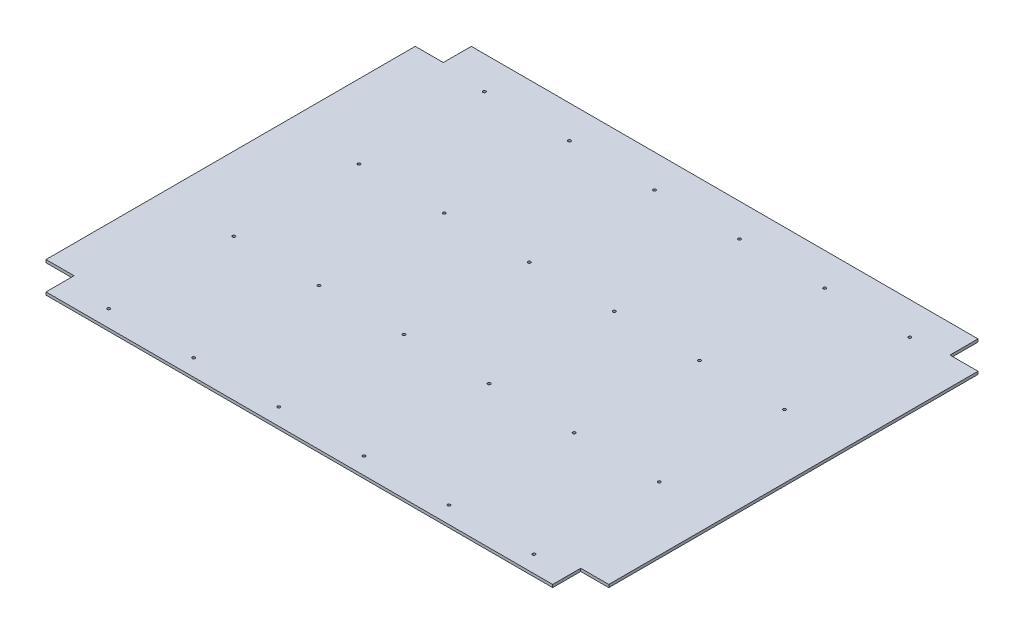
ISO-10303-21;
HEADER;
FILE_DESCRIPTION(('STEP AP214'),'2;1');
FILE_NAME('part.step','',(''),(''),'','','');
FILE_SCHEMA(('AUTOMOTIVE_DESIGN { 1 0 10303 214 1 1 1 1 }'));
ENDSEC;
DATA;
#1=APPLICATION_CONTEXT('core data for automotive mechanical design processes');
#2=APPLICATION_PROTOCOL_DEFINITION('international standard','automotive_design',2000,#1);
#3=PRODUCT_CONTEXT('',#1,'mechanical');
#4=PRODUCT('Part','Part','',(#3));
#5=PRODUCT_RELATED_PRODUCT_CATEGORY('part','',(#4));
#6=PRODUCT_DEFINITION_FORMATION('','',#4);
#7=PRODUCT_DEFINITION_CONTEXT('part definition',#1,'design');
#8=PRODUCT_DEFINITION('design','',#6,#7);
#9=PRODUCT_DEFINITION_SHAPE('','',#8);
#10=(LENGTH_UNIT() NAMED_UNIT(*) SI_UNIT(.MILLI.,.METRE.));
#11=(NAMED_UNIT(*) PLANE_ANGLE_UNIT() SI_UNIT($,.RADIAN.));
#12=(NAMED_UNIT(*) SI_UNIT($,.STERADIAN.) SOLID_ANGLE_UNIT());
#13=UNCERTAINTY_MEASURE_WITH_UNIT(LENGTH_MEASURE(1.E-05),#10,'distance_accuracy_value','');
#14=(GEOMETRIC_REPRESENTATION_CONTEXT(3) GLOBAL_UNCERTAINTY_ASSIGNED_CONTEXT((#13)) GLOBAL_UNIT_ASSIGNED_CONTEXT((#10,
#11,#12)) REPRESENTATION_CONTEXT('',''));
#15=CARTESIAN_POINT('',(0.,0.,0.));
#16=DIRECTION('',(0.,0.,1.));
#17=DIRECTION('',(1.,0.,0.));
#18=AXIS2_PLACEMENT_3D('',#15,#16,#17);
#19=CARTESIAN_POINT('',(542.,3.,0.));
#20=DIRECTION('',(-1.,0.,0.));
#21=DIRECTION('',(0.,0.,1.));
#22=AXIS2_PLACEMENT_3D('',#19,#20,#21);
#23=PLANE('',#22);
#24=DIRECTION('',(0.,-1.,0.));
#25=VECTOR('',#24,1.);
#26=CARTESIAN_POINT('',(542.,3.,-30.));
#27=LINE('',#26,#25);
#28=CARTESIAN_POINT('',(542.,3.,-30.));
#29=VERTEX_POINT('',#28);
#30=CARTESIAN_POINT('',(542.,0.,-30.));
#31=VERTEX_POINT('',#30);
#32=EDGE_CURVE('E136',#29,#31,#27,.T.);
#33=ORIENTED_EDGE('',*,*,#32,.F.);
#34=DIRECTION('',(0.,0.,-1.));
#35=VECTOR('',#34,1.);
#36=CARTESIAN_POINT('',(542.,3.,0.));
#37=LINE('',#36,#35);
#38=CARTESIAN_POINT('',(542.,3.,0.));
#39=VERTEX_POINT('',#38);
#40=EDGE_CURVE('E149',#39,#29,#37,.T.);
#41=ORIENTED_EDGE('',*,*,#40,.F.);
#42=DIRECTION('',(0.,-1.,0.));
#43=VECTOR('',#42,1.);
#44=CARTESIAN_POINT('',(542.,3.,0.));
#45=LINE('',#44,#43);
#46=CARTESIAN_POINT('',(542.,0.,0.));
#47=VERTEX_POINT('',#46);
#48=EDGE_CURVE('E48',#39,#47,#45,.T.);
#49=ORIENTED_EDGE('',*,*,#48,.T.);
#50=DIRECTION('',(0.,0.,-1.));
#51=VECTOR('',#50,1.);
#52=CARTESIAN_POINT('',(542.,0.,0.));
#53=LINE('',#52,#51);
#54=EDGE_CURVE('E151',#47,#31,#53,.T.);
#55=ORIENTED_EDGE('',*,*,#54,.T.);
#56=EDGE_LOOP('',(#33,#41,#49,#55));
#57=FACE_BOUND('',#56,.T.);
#58=ADVANCED_FACE('F39',(#57),#23,.F.);
#59=CARTESIAN_POINT('',(0.,3.,0.));
#60=DIRECTION('',(1.,0.,0.));
#61=DIRECTION('',(0.,0.,-1.));
#62=AXIS2_PLACEMENT_3D('',#59,#60,#61);
#63=PLANE('',#62);
#64=DIRECTION('',(0.,-1.,0.));
#65=VECTOR('',#64,1.);
#66=CARTESIAN_POINT('',(0.,3.,-425.));
#67=LINE('',#66,#65);
#68=CARTESIAN_POINT('',(0.,3.,-425.));
#69=VERTEX_POINT('',#68);
#70=CARTESIAN_POINT('',(0.,0.,-425.));
#71=VERTEX_POINT('',#70);
#72=EDGE_CURVE('E248',#69,#71,#67,.T.);
#73=ORIENTED_EDGE('',*,*,#72,.F.);
#74=DIRECTION('',(0.,0.,1.));
#75=VECTOR('',#74,1.);
#76=CARTESIAN_POINT('',(0.,3.,0.));
#77=LINE('',#76,#75);
#78=CARTESIAN_POINT('',(0.,3.,-455.));
#79=VERTEX_POINT('',#78);
#80=EDGE_CURVE('E443',#79,#69,#77,.T.);
#81=ORIENTED_EDGE('',*,*,#80,.F.);
#82=DIRECTION('',(0.,-1.,0.));
#83=VECTOR('',#82,1.);
#84=CARTESIAN_POINT('',(0.,3.,-455.));
#85=LINE('',#84,#83);
#86=CARTESIAN_POINT('',(0.,0.,-455.));
#87=VERTEX_POINT('',#86);
#88=EDGE_CURVE('E167',#79,#87,#85,.T.);
#89=ORIENTED_EDGE('',*,*,#88,.T.);
#90=DIRECTION('',(0.,0.,1.));
#91=VECTOR('',#90,1.);
#92=CARTESIAN_POINT('',(0.,0.,0.));
#93=LINE('',#92,#91);
#94=EDGE_CURVE('E172',#87,#71,#93,.T.);
#95=ORIENTED_EDGE('',*,*,#94,.T.);
#96=EDGE_LOOP('',(#73,#81,#89,#95));
#97=FACE_BOUND('',#96,.T.);
#98=ADVANCED_FACE('F473',(#97),#63,.F.);
#99=CARTESIAN_POINT('',(0.,3.,0.));
#100=DIRECTION('',(0.,-1.,0.));
#101=DIRECTION('',(0.,0.,-1.));
#102=AXIS2_PLACEMENT_3D('',#99,#100,#101);
#103=PLANE('',#102);
#104=ORIENTED_EDGE('',*,*,#80,.T.);
#105=DIRECTION('',(-1.,0.,0.));
#106=VECTOR('',#105,1.);
#107=CARTESIAN_POINT('',(0.,3.,-425.));
#108=LINE('',#107,#106);
#109=CARTESIAN_POINT('',(-30.,3.,-425.));
#110=VERTEX_POINT('',#109);
#111=EDGE_CURVE('E222',#69,#110,#108,.T.);
#112=ORIENTED_EDGE('',*,*,#111,.T.);
#113=DIRECTION('',(0.,0.,1.));
#114=VECTOR('',#113,1.);
#115=CARTESIAN_POINT('',(-30.,3.,-30.));
#116=LINE('',#115,#114);
#117=CARTESIAN_POINT('',(-30.,3.,-30.));
#118=VERTEX_POINT('',#117);
#119=EDGE_CURVE('E225',#110,#118,#116,.T.);
#120=ORIENTED_EDGE('',*,*,#119,.T.);
#121=DIRECTION('',(1.,0.,0.));
#122=VECTOR('',#121,1.);
#123=CARTESIAN_POINT('',(0.,3.,-30.));
#124=LINE('',#123,#122);
#125=CARTESIAN_POINT('',(0.,3.,-30.));
#126=VERTEX_POINT('',#125);
#127=EDGE_CURVE('E228',#118,#126,#124,.T.);
#128=ORIENTED_EDGE('',*,*,#127,.T.);
#129=CARTESIAN_POINT('',(0.,3.,0.));
#130=VERTEX_POINT('',#129);
#131=EDGE_CURVE('E186',#126,#130,#77,.T.);
#132=ORIENTED_EDGE('',*,*,#131,.T.);
#133=DIRECTION('',(1.,0.,0.));
#134=VECTOR('',#133,1.);
#135=CARTESIAN_POINT('',(0.,3.,0.));
#136=LINE('',#135,#134);
#137=EDGE_CURVE('E159',#130,#39,#136,.T.);
#138=ORIENTED_EDGE('',*,*,#137,.T.);
#139=ORIENTED_EDGE('',*,*,#40,.T.);
#140=DIRECTION('',(1.,0.,0.));
#141=VECTOR('',#140,1.);
#142=CARTESIAN_POINT('',(542.,3.,-30.));
#143=LINE('',#142,#141);
#144=CARTESIAN_POINT('',(572.,3.,-30.));
#145=VERTEX_POINT('',#144);
#146=EDGE_CURVE('E133',#29,#145,#143,.T.);
#147=ORIENTED_EDGE('',*,*,#146,.T.);
#148=DIRECTION('',(0.,0.,-1.));
#149=VECTOR('',#148,1.);
#150=CARTESIAN_POINT('',(572.,3.,-30.));
#151=LINE('',#150,#149);
#152=CARTESIAN_POINT('',(572.,3.,-425.));
#153=VERTEX_POINT('',#152);
#154=EDGE_CURVE('E144',#145,#153,#151,.T.);
#155=ORIENTED_EDGE('',*,*,#154,.T.);
#156=DIRECTION('',(-1.,0.,0.));
#157=VECTOR('',#156,1.);
#158=CARTESIAN_POINT('',(542.,3.,-425.));
#159=LINE('',#158,#157);
#160=CARTESIAN_POINT('',(542.,3.,-425.));
#161=VERTEX_POINT('',#160);
#162=EDGE_CURVE('E209',#153,#161,#159,.T.);
#163=ORIENTED_EDGE('',*,*,#162,.T.);
#164=CARTESIAN_POINT('',(542.,3.,-455.));
#165=VERTEX_POINT('',#164);
#166=EDGE_CURVE('E163',#161,#165,#37,.T.);
#167=ORIENTED_EDGE('',*,*,#166,.T.);
#168=DIRECTION('',(-1.,0.,0.));
#169=VECTOR('',#168,1.);
#170=CARTESIAN_POINT('',(0.,3.,-455.));
#171=LINE('',#170,#169);
#172=EDGE_CURVE('E162',#165,#79,#171,.T.);
#173=ORIENTED_EDGE('',*,*,#172,.T.);
#174=EDGE_LOOP('',(#104,#112,#120,#128,#132,#138,#139,#147,#155,#163,#167,#173));
#175=FACE_BOUND('',#174,.T.);
#176=CARTESIAN_POINT('',(140.,3.,-18.));
#177=DIRECTION('',(0.,1.,0.));
#178=DIRECTION('',(0.,0.,1.));
#179=AXIS2_PLACEMENT_3D('',#176,#177,#178);
#180=CIRCLE('',#179,1.5);
#181=CARTESIAN_POINT('',(140.,3.,-16.5));
#182=VERTEX_POINT('',#181);
#183=EDGE_CURVE('E437',#182,#182,#180,.T.);
#184=ORIENTED_EDGE('',*,*,#183,.F.);
#185=EDGE_LOOP('',(#184));
#186=FACE_BOUND('',#185,.T.);
#187=CARTESIAN_POINT('',(49.,3.,-18.));
#188=DIRECTION('',(0.,1.,0.));
#189=DIRECTION('',(0.,0.,1.));
#190=AXIS2_PLACEMENT_3D('',#187,#188,#189);
#191=CIRCLE('',#190,1.5);
#192=CARTESIAN_POINT('',(49.,3.,-16.5));
#193=VERTEX_POINT('',#192);
#194=EDGE_CURVE('E429',#193,#193,#191,.T.);
#195=ORIENTED_EDGE('',*,*,#194,.F.);
#196=EDGE_LOOP('',(#195));
#197=FACE_BOUND('',#196,.T.);
#198=CARTESIAN_POINT('',(231.,3.,-18.));
#199=DIRECTION('',(0.,1.,0.));
#200=DIRECTION('',(0.,0.,1.));
#201=AXIS2_PLACEMENT_3D('',#198,#199,#200);
#202=CIRCLE('',#201,1.5);
#203=CARTESIAN_POINT('',(231.,3.,-16.5));
#204=VERTEX_POINT('',#203);
#205=EDGE_CURVE('E421',#204,#204,#202,.T.);
#206=ORIENTED_EDGE('',*,*,#205,.F.);
#207=EDGE_LOOP('',(#206));
#208=FACE_BOUND('',#207,.T.);
#209=CARTESIAN_POINT('',(413.,3.,-18.));
#210=DIRECTION('',(0.,1.,0.));
#211=DIRECTION('',(0.,0.,1.));
#212=AXIS2_PLACEMENT_3D('',#209,#210,#211);
#213=CIRCLE('',#212,1.50000000000002);
#214=CARTESIAN_POINT('',(413.,3.,-16.5));
#215=VERTEX_POINT('',#214);
#216=EDGE_CURVE('E413',#215,#215,#213,.T.);
#217=ORIENTED_EDGE('',*,*,#216,.F.);
#218=EDGE_LOOP('',(#217));
#219=FACE_BOUND('',#218,.T.);
#220=CARTESIAN_POINT('',(504.,3.,-18.));
#221=DIRECTION('',(0.,1.,0.));
#222=DIRECTION('',(0.,0.,1.));
#223=AXIS2_PLACEMENT_3D('',#220,#221,#222);
#224=CIRCLE('',#223,1.49999999999997);
#225=CARTESIAN_POINT('',(504.,3.,-16.5));
#226=VERTEX_POINT('',#225);
#227=EDGE_CURVE('E405',#226,#226,#224,.T.);
#228=ORIENTED_EDGE('',*,*,#227,.F.);
#229=EDGE_LOOP('',(#228));
#230=FACE_BOUND('',#229,.T.);
#231=CARTESIAN_POINT('',(322.,3.,-18.));
#232=DIRECTION('',(0.,1.,0.));
#233=DIRECTION('',(0.,0.,1.));
#234=AXIS2_PLACEMENT_3D('',#231,#232,#233);
#235=CIRCLE('',#234,1.50000000000002);
#236=CARTESIAN_POINT('',(322.,3.,-16.5));
#237=VERTEX_POINT('',#236);
#238=EDGE_CURVE('E397',#237,#237,#235,.T.);
#239=ORIENTED_EDGE('',*,*,#238,.F.);
#240=EDGE_LOOP('',(#239));
#241=FACE_BOUND('',#240,.T.);
#242=CARTESIAN_POINT('',(140.,3.,-152.));
#243=DIRECTION('',(0.,1.,0.));
#244=DIRECTION('',(0.,0.,1.));
#245=AXIS2_PLACEMENT_3D('',#242,#243,#244);
#246=CIRCLE('',#245,1.5);
#247=CARTESIAN_POINT('',(140.,3.,-150.5));
#248=VERTEX_POINT('',#247);
#249=EDGE_CURVE('E389',#248,#248,#246,.T.);
#250=ORIENTED_EDGE('',*,*,#249,.F.);
#251=EDGE_LOOP('',(#250));
#252=FACE_BOUND('',#251,.T.);
#253=CARTESIAN_POINT('',(231.,3.,-152.));
#254=DIRECTION('',(0.,1.,0.));
#255=DIRECTION('',(0.,0.,1.));
#256=AXIS2_PLACEMENT_3D('',#253,#254,#255);
#257=CIRCLE('',#256,1.5);
#258=CARTESIAN_POINT('',(231.,3.,-150.5));
#259=VERTEX_POINT('',#258);
#260=EDGE_CURVE('E381',#259,#259,#257,.T.);
#261=ORIENTED_EDGE('',*,*,#260,.F.);
#262=EDGE_LOOP('',(#261));
#263=FACE_BOUND('',#262,.T.);
#264=CARTESIAN_POINT('',(322.,3.,-152.));
#265=DIRECTION('',(0.,1.,0.));
#266=DIRECTION('',(0.,0.,1.));
#267=AXIS2_PLACEMENT_3D('',#264,#265,#266);
#268=CIRCLE('',#267,1.50000000000002);
#269=CARTESIAN_POINT('',(322.,3.,-150.5));
#270=VERTEX_POINT('',#269);
#271=EDGE_CURVE('E373',#270,#270,#268,.T.);
#272=ORIENTED_EDGE('',*,*,#271,.F.);
#273=EDGE_LOOP('',(#272));
#274=FACE_BOUND('',#273,.T.);
#275=CARTESIAN_POINT('',(413.,3.,-152.));
#276=DIRECTION('',(0.,1.,0.));
#277=DIRECTION('',(0.,0.,1.));
#278=AXIS2_PLACEMENT_3D('',#275,#276,#277);
#279=CIRCLE('',#278,1.50000000000002);
#280=CARTESIAN_POINT('',(413.,3.,-150.5));
#281=VERTEX_POINT('',#280);
#282=EDGE_CURVE('E365',#281,#281,#279,.T.);
#283=ORIENTED_EDGE('',*,*,#282,.F.);
#284=EDGE_LOOP('',(#283));
#285=FACE_BOUND('',#284,.T.);
#286=CARTESIAN_POINT('',(504.,3.,-152.));
#287=DIRECTION('',(0.,1.,0.));
#288=DIRECTION('',(0.,0.,1.));
#289=AXIS2_PLACEMENT_3D('',#286,#287,#288);
#290=CIRCLE('',#289,1.49999999999996);
#291=CARTESIAN_POINT('',(504.,3.,-150.5));
#292=VERTEX_POINT('',#291);
#293=EDGE_CURVE('E357',#292,#292,#290,.T.);
#294=ORIENTED_EDGE('',*,*,#293,.F.);
#295=EDGE_LOOP('',(#294));
#296=FACE_BOUND('',#295,.T.);
#297=CARTESIAN_POINT('',(49.,3.,-286.));
#298=DIRECTION('',(0.,1.,0.));
#299=DIRECTION('',(0.,0.,1.));
#300=AXIS2_PLACEMENT_3D('',#297,#298,#299);
#301=CIRCLE('',#300,1.5);
#302=CARTESIAN_POINT('',(49.,3.,-284.5));
#303=VERTEX_POINT('',#302);
#304=EDGE_CURVE('E349',#303,#303,#301,.T.);
#305=ORIENTED_EDGE('',*,*,#304,.F.);
#306=EDGE_LOOP('',(#305));
#307=FACE_BOUND('',#306,.T.);
#308=CARTESIAN_POINT('',(140.,3.,-286.));
#309=DIRECTION('',(0.,1.,0.));
#310=DIRECTION('',(0.,0.,1.));
#311=AXIS2_PLACEMENT_3D('',#308,#309,#310);
#312=CIRCLE('',#311,1.5);
#313=CARTESIAN_POINT('',(140.,3.,-284.5));
#314=VERTEX_POINT('',#313);
#315=EDGE_CURVE('E341',#314,#314,#312,.T.);
#316=ORIENTED_EDGE('',*,*,#315,.F.);
#317=EDGE_LOOP('',(#316));
#318=FACE_BOUND('',#317,.T.);
#319=CARTESIAN_POINT('',(231.,3.,-286.));
#320=DIRECTION('',(0.,1.,0.));
#321=DIRECTION('',(0.,0.,1.));
#322=AXIS2_PLACEMENT_3D('',#319,#320,#321);
#323=CIRCLE('',#322,1.5);
#324=CARTESIAN_POINT('',(231.,3.,-284.5));
#325=VERTEX_POINT('',#324);
#326=EDGE_CURVE('E333',#325,#325,#323,.T.);
#327=ORIENTED_EDGE('',*,*,#326,.F.);
#328=EDGE_LOOP('',(#327));
#329=FACE_BOUND('',#328,.T.);
#330=CARTESIAN_POINT('',(322.,3.,-286.));
#331=DIRECTION('',(0.,1.,0.));
#332=DIRECTION('',(0.,0.,1.));
#333=AXIS2_PLACEMENT_3D('',#330,#331,#332);
#334=CIRCLE('',#333,1.50000000000002);
#335=CARTESIAN_POINT('',(322.,3.,-284.5));
#336=VERTEX_POINT('',#335);
#337=EDGE_CURVE('E325',#336,#336,#334,.T.);
#338=ORIENTED_EDGE('',*,*,#337,.F.);
#339=EDGE_LOOP('',(#338));
#340=FACE_BOUND('',#339,.T.);
#341=CARTESIAN_POINT('',(413.,3.,-286.));
#342=DIRECTION('',(0.,1.,0.));
#343=DIRECTION('',(0.,0.,1.));
#344=AXIS2_PLACEMENT_3D('',#341,#342,#343);
#345=CIRCLE('',#344,1.50000000000002);
#346=CARTESIAN_POINT('',(413.,3.,-284.5));
#347=VERTEX_POINT('',#346);
#348=EDGE_CURVE('E317',#347,#347,#345,.T.);
#349=ORIENTED_EDGE('',*,*,#348,.F.);
#350=EDGE_LOOP('',(#349));
#351=FACE_BOUND('',#350,.T.);
#352=CARTESIAN_POINT('',(49.,3.,-152.));
#353=DIRECTION('',(0.,1.,0.));
#354=DIRECTION('',(0.,0.,1.));
#355=AXIS2_PLACEMENT_3D('',#352,#353,#354);
#356=CIRCLE('',#355,1.5);
#357=CARTESIAN_POINT('',(49.,3.,-150.5));
#358=VERTEX_POINT('',#357);
#359=EDGE_CURVE('E309',#358,#358,#356,.T.);
#360=ORIENTED_EDGE('',*,*,#359,.F.);
#361=EDGE_LOOP('',(#360));
#362=FACE_BOUND('',#361,.T.);
#363=CARTESIAN_POINT('',(504.,3.,-286.));
#364=DIRECTION('',(0.,1.,0.));
#365=DIRECTION('',(0.,0.,1.));
#366=AXIS2_PLACEMENT_3D('',#363,#364,#365);
#367=CIRCLE('',#366,1.49999999999997);
#368=CARTESIAN_POINT('',(504.,3.,-284.5));
#369=VERTEX_POINT('',#368);
#370=EDGE_CURVE('E301',#369,#369,#367,.T.);
#371=ORIENTED_EDGE('',*,*,#370,.F.);
#372=EDGE_LOOP('',(#371));
#373=FACE_BOUND('',#372,.T.);
#374=CARTESIAN_POINT('',(49.,3.,-420.));
#375=DIRECTION('',(0.,1.,0.));
#376=DIRECTION('',(0.,0.,1.));
#377=AXIS2_PLACEMENT_3D('',#374,#375,#376);
#378=CIRCLE('',#377,1.5);
#379=CARTESIAN_POINT('',(49.,3.,-418.5));
#380=VERTEX_POINT('',#379);
#381=EDGE_CURVE('E293',#380,#380,#378,.T.);
#382=ORIENTED_EDGE('',*,*,#381,.F.);
#383=EDGE_LOOP('',(#382));
#384=FACE_BOUND('',#383,.T.);
#385=CARTESIAN_POINT('',(140.,3.,-420.));
#386=DIRECTION('',(0.,1.,0.));
#387=DIRECTION('',(0.,0.,1.));
#388=AXIS2_PLACEMENT_3D('',#385,#386,#387);
#389=CIRCLE('',#388,1.5);
#390=CARTESIAN_POINT('',(140.,3.,-418.5));
#391=VERTEX_POINT('',#390);
#392=EDGE_CURVE('E285',#391,#391,#389,.T.);
#393=ORIENTED_EDGE('',*,*,#392,.F.);
#394=EDGE_LOOP('',(#393));
#395=FACE_BOUND('',#394,.T.);
#396=CARTESIAN_POINT('',(231.,3.,-420.));
#397=DIRECTION('',(0.,1.,0.));
#398=DIRECTION('',(0.,0.,1.));
#399=AXIS2_PLACEMENT_3D('',#396,#397,#398);
#400=CIRCLE('',#399,1.5);
#401=CARTESIAN_POINT('',(231.,3.,-418.5));
#402=VERTEX_POINT('',#401);
#403=EDGE_CURVE('E277',#402,#402,#400,.T.);
#404=ORIENTED_EDGE('',*,*,#403,.F.);
#405=EDGE_LOOP('',(#404));
#406=FACE_BOUND('',#405,.T.);
#407=CARTESIAN_POINT('',(322.,3.,-420.));
#408=DIRECTION('',(0.,1.,0.));
#409=DIRECTION('',(0.,0.,1.));
#410=AXIS2_PLACEMENT_3D('',#407,#408,#409);
#411=CIRCLE('',#410,1.50000000000002);
#412=CARTESIAN_POINT('',(322.,3.,-418.5));
#413=VERTEX_POINT('',#412);
#414=EDGE_CURVE('E269',#413,#413,#411,.T.);
#415=ORIENTED_EDGE('',*,*,#414,.F.);
#416=EDGE_LOOP('',(#415));
#417=FACE_BOUND('',#416,.T.);
#418=CARTESIAN_POINT('',(413.,3.,-420.));
#419=DIRECTION('',(0.,1.,0.));
#420=DIRECTION('',(0.,0.,1.));
#421=AXIS2_PLACEMENT_3D('',#418,#419,#420);
#422=CIRCLE('',#421,1.50000000000002);
#423=CARTESIAN_POINT('',(413.,3.,-418.5));
#424=VERTEX_POINT('',#423);
#425=EDGE_CURVE('E261',#424,#424,#422,.T.);
#426=ORIENTED_EDGE('',*,*,#425,.F.);
#427=EDGE_LOOP('',(#426));
#428=FACE_BOUND('',#427,.T.);
#429=CARTESIAN_POINT('',(504.,3.,-420.));
#430=DIRECTION('',(0.,1.,0.));
#431=DIRECTION('',(0.,0.,1.));
#432=AXIS2_PLACEMENT_3D('',#429,#430,#431);
#433=CIRCLE('',#432,1.49999999999997);
#434=CARTESIAN_POINT('',(504.,3.,-418.5));
#435=VERTEX_POINT('',#434);
#436=EDGE_CURVE('E253',#435,#435,#433,.T.);
#437=ORIENTED_EDGE('',*,*,#436,.F.);
#438=EDGE_LOOP('',(#437));
#439=FACE_BOUND('',#438,.T.);
#440=ADVANCED_FACE('F156',(#175,#186,#197,#208,#219,#230,#241,#252,#263,#274,#285,#296,#307,
#318,#329,#340,#351,#362,#373,#384,#395,#406,#417,#428,#439),#103,.F.);
#441=CARTESIAN_POINT('',(0.,0.,0.));
#442=DIRECTION('',(0.,-1.,0.));
#443=DIRECTION('',(0.,0.,-1.));
#444=AXIS2_PLACEMENT_3D('',#441,#442,#443);
#445=PLANE('',#444);
#446=CARTESIAN_POINT('',(413.,0.,-420.));
#447=DIRECTION('',(0.,1.,0.));
#448=DIRECTION('',(0.,0.,1.));
#449=AXIS2_PLACEMENT_3D('',#446,#447,#448);
#450=CIRCLE('',#449,1.50000000000002);
#451=CARTESIAN_POINT('',(413.,0.,-418.5));
#452=VERTEX_POINT('',#451);
#453=EDGE_CURVE('E257',#452,#452,#450,.T.);
#454=ORIENTED_EDGE('',*,*,#453,.T.);
#455=EDGE_LOOP('',(#454));
#456=FACE_BOUND('',#455,.T.);
#457=CARTESIAN_POINT('',(231.,0.,-420.));
#458=DIRECTION('',(0.,1.,0.));
#459=DIRECTION('',(0.,0.,1.));
#460=AXIS2_PLACEMENT_3D('',#457,#458,#459);
#461=CIRCLE('',#460,1.5);
#462=CARTESIAN_POINT('',(231.,0.,-418.5));
#463=VERTEX_POINT('',#462);
#464=EDGE_CURVE('E273',#463,#463,#461,.T.);
#465=ORIENTED_EDGE('',*,*,#464,.T.);
#466=EDGE_LOOP('',(#465));
#467=FACE_BOUND('',#466,.T.);
#468=CARTESIAN_POINT('',(49.,0.,-420.));
#469=DIRECTION('',(0.,1.,0.));
#470=DIRECTION('',(0.,0.,1.));
#471=AXIS2_PLACEMENT_3D('',#468,#469,#470);
#472=CIRCLE('',#471,1.5);
#473=CARTESIAN_POINT('',(49.,0.,-418.5));
#474=VERTEX_POINT('',#473);
#475=EDGE_CURVE('E289',#474,#474,#472,.T.);
#476=ORIENTED_EDGE('',*,*,#475,.T.);
#477=EDGE_LOOP('',(#476));
#478=FACE_BOUND('',#477,.T.);
#479=CARTESIAN_POINT('',(49.,0.,-152.));
#480=DIRECTION('',(0.,1.,0.));
#481=DIRECTION('',(0.,0.,1.));
#482=AXIS2_PLACEMENT_3D('',#479,#480,#481);
#483=CIRCLE('',#482,1.5);
#484=CARTESIAN_POINT('',(49.,0.,-150.5));
#485=VERTEX_POINT('',#484);
#486=EDGE_CURVE('E305',#485,#485,#483,.T.);
#487=ORIENTED_EDGE('',*,*,#486,.T.);
#488=EDGE_LOOP('',(#487));
#489=FACE_BOUND('',#488,.T.);
#490=CARTESIAN_POINT('',(322.,0.,-286.));
#491=DIRECTION('',(0.,1.,0.));
#492=DIRECTION('',(0.,0.,1.));
#493=AXIS2_PLACEMENT_3D('',#490,#491,#492);
#494=CIRCLE('',#493,1.50000000000002);
#495=CARTESIAN_POINT('',(322.,0.,-284.5));
#496=VERTEX_POINT('',#495);
#497=EDGE_CURVE('E321',#496,#496,#494,.T.);
#498=ORIENTED_EDGE('',*,*,#497,.T.);
#499=EDGE_LOOP('',(#498));
#500=FACE_BOUND('',#499,.T.);
#501=CARTESIAN_POINT('',(140.,0.,-286.));
#502=DIRECTION('',(0.,1.,0.));
#503=DIRECTION('',(0.,0.,1.));
#504=AXIS2_PLACEMENT_3D('',#501,#502,#503);
#505=CIRCLE('',#504,1.5);
#506=CARTESIAN_POINT('',(140.,0.,-284.5));
#507=VERTEX_POINT('',#506);
#508=EDGE_CURVE('E337',#507,#507,#505,.T.);
#509=ORIENTED_EDGE('',*,*,#508,.T.);
#510=EDGE_LOOP('',(#509));
#511=FACE_BOUND('',#510,.T.);
#512=CARTESIAN_POINT('',(504.,0.,-152.));
#513=DIRECTION('',(0.,1.,0.));
#514=DIRECTION('',(0.,0.,1.));
#515=AXIS2_PLACEMENT_3D('',#512,#513,#514);
#516=CIRCLE('',#515,1.49999999999996);
#517=CARTESIAN_POINT('',(504.,0.,-150.5));
#518=VERTEX_POINT('',#517);
#519=EDGE_CURVE('E353',#518,#518,#516,.T.);
#520=ORIENTED_EDGE('',*,*,#519,.T.);
#521=EDGE_LOOP('',(#520));
#522=FACE_BOUND('',#521,.T.);
#523=CARTESIAN_POINT('',(322.,0.,-152.));
#524=DIRECTION('',(0.,1.,0.));
#525=DIRECTION('',(0.,0.,1.));
#526=AXIS2_PLACEMENT_3D('',#523,#524,#525);
#527=CIRCLE('',#526,1.50000000000002);
#528=CARTESIAN_POINT('',(322.,0.,-150.5));
#529=VERTEX_POINT('',#528);
#530=EDGE_CURVE('E369',#529,#529,#527,.T.);
#531=ORIENTED_EDGE('',*,*,#530,.T.);
#532=EDGE_LOOP('',(#531));
#533=FACE_BOUND('',#532,.T.);
#534=CARTESIAN_POINT('',(140.,0.,-152.));
#535=DIRECTION('',(0.,1.,0.));
#536=DIRECTION('',(0.,0.,1.));
#537=AXIS2_PLACEMENT_3D('',#534,#535,#536);
#538=CIRCLE('',#537,1.5);
#539=CARTESIAN_POINT('',(140.,0.,-150.5));
#540=VERTEX_POINT('',#539);
#541=EDGE_CURVE('E385',#540,#540,#538,.T.);
#542=ORIENTED_EDGE('',*,*,#541,.T.);
#543=EDGE_LOOP('',(#542));
#544=FACE_BOUND('',#543,.T.);
#545=CARTESIAN_POINT('',(504.,0.,-18.));
#546=DIRECTION('',(0.,1.,0.));
#547=DIRECTION('',(0.,0.,1.));
#548=AXIS2_PLACEMENT_3D('',#545,#546,#547);
#549=CIRCLE('',#548,1.49999999999997);
#550=CARTESIAN_POINT('',(504.,0.,-16.5));
#551=VERTEX_POINT('',#550);
#552=EDGE_CURVE('E401',#551,#551,#549,.T.);
#553=ORIENTED_EDGE('',*,*,#552,.T.);
#554=EDGE_LOOP('',(#553));
#555=FACE_BOUND('',#554,.T.);
#556=CARTESIAN_POINT('',(231.,0.,-18.));
#557=DIRECTION('',(0.,1.,0.));
#558=DIRECTION('',(0.,0.,1.));
#559=AXIS2_PLACEMENT_3D('',#556,#557,#558);
#560=CIRCLE('',#559,1.5);
#561=CARTESIAN_POINT('',(231.,0.,-16.5));
#562=VERTEX_POINT('',#561);
#563=EDGE_CURVE('E417',#562,#562,#560,.T.);
#564=ORIENTED_EDGE('',*,*,#563,.T.);
#565=EDGE_LOOP('',(#564));
#566=FACE_BOUND('',#565,.T.);
#567=CARTESIAN_POINT('',(140.,0.,-18.));
#568=DIRECTION('',(0.,1.,0.));
#569=DIRECTION('',(0.,0.,1.));
#570=AXIS2_PLACEMENT_3D('',#567,#568,#569);
#571=CIRCLE('',#570,1.5);
#572=CARTESIAN_POINT('',(140.,0.,-16.5));
#573=VERTEX_POINT('',#572);
#574=EDGE_CURVE('E433',#573,#573,#571,.T.);
#575=ORIENTED_EDGE('',*,*,#574,.T.);
#576=EDGE_LOOP('',(#575));
#577=FACE_BOUND('',#576,.T.);
#578=ORIENTED_EDGE('',*,*,#94,.F.);
#579=DIRECTION('',(-1.,0.,0.));
#580=VECTOR('',#579,1.);
#581=CARTESIAN_POINT('',(0.,0.,-455.));
#582=LINE('',#581,#580);
#583=CARTESIAN_POINT('',(542.,0.,-455.));
#584=VERTEX_POINT('',#583);
#585=EDGE_CURVE('E183',#584,#87,#582,.T.);
#586=ORIENTED_EDGE('',*,*,#585,.F.);
#587=CARTESIAN_POINT('',(542.,0.,-425.));
#588=VERTEX_POINT('',#587);
#589=EDGE_CURVE('E180',#588,#584,#53,.T.);
#590=ORIENTED_EDGE('',*,*,#589,.F.);
#591=DIRECTION('',(-1.,0.,0.));
#592=VECTOR('',#591,1.);
#593=CARTESIAN_POINT('',(542.,0.,-425.));
#594=LINE('',#593,#592);
#595=CARTESIAN_POINT('',(572.,0.,-425.));
#596=VERTEX_POINT('',#595);
#597=EDGE_CURVE('E55',#596,#588,#594,.T.);
#598=ORIENTED_EDGE('',*,*,#597,.F.);
#599=DIRECTION('',(0.,0.,-1.));
#600=VECTOR('',#599,1.);
#601=CARTESIAN_POINT('',(572.,0.,-30.));
#602=LINE('',#601,#600);
#603=CARTESIAN_POINT('',(572.,0.,-30.));
#604=VERTEX_POINT('',#603);
#605=EDGE_CURVE('E203',#604,#596,#602,.T.);
#606=ORIENTED_EDGE('',*,*,#605,.F.);
#607=DIRECTION('',(1.,0.,0.));
#608=VECTOR('',#607,1.);
#609=CARTESIAN_POINT('',(542.,0.,-30.));
#610=LINE('',#609,#608);
#611=EDGE_CURVE('E202',#31,#604,#610,.T.);
#612=ORIENTED_EDGE('',*,*,#611,.F.);
#613=ORIENTED_EDGE('',*,*,#54,.F.);
#614=DIRECTION('',(1.,0.,0.));
#615=VECTOR('',#614,1.);
#616=CARTESIAN_POINT('',(0.,0.,0.));
#617=LINE('',#616,#615);
#618=CARTESIAN_POINT('',(0.,0.,0.));
#619=VERTEX_POINT('',#618);
#620=EDGE_CURVE('E176',#619,#47,#617,.T.);
#621=ORIENTED_EDGE('',*,*,#620,.F.);
#622=CARTESIAN_POINT('',(0.,0.,-30.));
#623=VERTEX_POINT('',#622);
#624=EDGE_CURVE('E177',#623,#619,#93,.T.);
#625=ORIENTED_EDGE('',*,*,#624,.F.);
#626=DIRECTION('',(1.,0.,0.));
#627=VECTOR('',#626,1.);
#628=CARTESIAN_POINT('',(0.,0.,-30.));
#629=LINE('',#628,#627);
#630=CARTESIAN_POINT('',(-30.,0.,-30.));
#631=VERTEX_POINT('',#630);
#632=EDGE_CURVE('E63',#631,#623,#629,.T.);
#633=ORIENTED_EDGE('',*,*,#632,.F.);
#634=DIRECTION('',(0.,0.,1.));
#635=VECTOR('',#634,1.);
#636=CARTESIAN_POINT('',(-30.,0.,-30.));
#637=LINE('',#636,#635);
#638=CARTESIAN_POINT('',(-30.,0.,-425.));
#639=VERTEX_POINT('',#638);
#640=EDGE_CURVE('E234',#639,#631,#637,.T.);
#641=ORIENTED_EDGE('',*,*,#640,.F.);
#642=DIRECTION('',(-1.,0.,0.));
#643=VECTOR('',#642,1.);
#644=CARTESIAN_POINT('',(0.,0.,-425.));
#645=LINE('',#644,#643);
#646=EDGE_CURVE('E153',#71,#639,#645,.T.);
#647=ORIENTED_EDGE('',*,*,#646,.F.);
#648=EDGE_LOOP('',(#578,#586,#590,#598,#606,#612,#613,#621,#625,#633,#641,#647));
#649=FACE_BOUND('',#648,.T.);
#650=CARTESIAN_POINT('',(49.,0.,-18.));
#651=DIRECTION('',(0.,1.,0.));
#652=DIRECTION('',(0.,0.,1.));
#653=AXIS2_PLACEMENT_3D('',#650,#651,#652);
#654=CIRCLE('',#653,1.5);
#655=CARTESIAN_POINT('',(49.,0.,-16.5));
#656=VERTEX_POINT('',#655);
#657=EDGE_CURVE('E425',#656,#656,#654,.T.);
#658=ORIENTED_EDGE('',*,*,#657,.T.);
#659=EDGE_LOOP('',(#658));
#660=FACE_BOUND('',#659,.T.);
#661=CARTESIAN_POINT('',(413.,0.,-18.));
#662=DIRECTION('',(0.,1.,0.));
#663=DIRECTION('',(0.,0.,1.));
#664=AXIS2_PLACEMENT_3D('',#661,#662,#663);
#665=CIRCLE('',#664,1.50000000000002);
#666=CARTESIAN_POINT('',(413.,0.,-16.5));
#667=VERTEX_POINT('',#666);
#668=EDGE_CURVE('E409',#667,#667,#665,.T.);
#669=ORIENTED_EDGE('',*,*,#668,.T.);
#670=EDGE_LOOP('',(#669));
#671=FACE_BOUND('',#670,.T.);
#672=CARTESIAN_POINT('',(322.,0.,-18.));
#673=DIRECTION('',(0.,1.,0.));
#674=DIRECTION('',(0.,0.,1.));
#675=AXIS2_PLACEMENT_3D('',#672,#673,#674);
#676=CIRCLE('',#675,1.50000000000002);
#677=CARTESIAN_POINT('',(322.,0.,-16.5));
#678=VERTEX_POINT('',#677);
#679=EDGE_CURVE('E393',#678,#678,#676,.T.);
#680=ORIENTED_EDGE('',*,*,#679,.T.);
#681=EDGE_LOOP('',(#680));
#682=FACE_BOUND('',#681,.T.);
#683=CARTESIAN_POINT('',(231.,0.,-152.));
#684=DIRECTION('',(0.,1.,0.));
#685=DIRECTION('',(0.,0.,1.));
#686=AXIS2_PLACEMENT_3D('',#683,#684,#685);
#687=CIRCLE('',#686,1.5);
#688=CARTESIAN_POINT('',(231.,0.,-150.5));
#689=VERTEX_POINT('',#688);
#690=EDGE_CURVE('E377',#689,#689,#687,.T.);
#691=ORIENTED_EDGE('',*,*,#690,.T.);
#692=EDGE_LOOP('',(#691));
#693=FACE_BOUND('',#692,.T.);
#694=CARTESIAN_POINT('',(413.,0.,-152.));
#695=DIRECTION('',(0.,1.,0.));
#696=DIRECTION('',(0.,0.,1.));
#697=AXIS2_PLACEMENT_3D('',#694,#695,#696);
#698=CIRCLE('',#697,1.50000000000002);
#699=CARTESIAN_POINT('',(413.,0.,-150.5));
#700=VERTEX_POINT('',#699);
#701=EDGE_CURVE('E361',#700,#700,#698,.T.);
#702=ORIENTED_EDGE('',*,*,#701,.T.);
#703=EDGE_LOOP('',(#702));
#704=FACE_BOUND('',#703,.T.);
#705=CARTESIAN_POINT('',(49.,0.,-286.));
#706=DIRECTION('',(0.,1.,0.));
#707=DIRECTION('',(0.,0.,1.));
#708=AXIS2_PLACEMENT_3D('',#705,#706,#707);
#709=CIRCLE('',#708,1.5);
#710=CARTESIAN_POINT('',(49.,0.,-284.5));
#711=VERTEX_POINT('',#710);
#712=EDGE_CURVE('E345',#711,#711,#709,.T.);
#713=ORIENTED_EDGE('',*,*,#712,.T.);
#714=EDGE_LOOP('',(#713));
#715=FACE_BOUND('',#714,.T.);
#716=CARTESIAN_POINT('',(231.,0.,-286.));
#717=DIRECTION('',(0.,1.,0.));
#718=DIRECTION('',(0.,0.,1.));
#719=AXIS2_PLACEMENT_3D('',#716,#717,#718);
#720=CIRCLE('',#719,1.5);
#721=CARTESIAN_POINT('',(231.,0.,-284.5));
#722=VERTEX_POINT('',#721);
#723=EDGE_CURVE('E329',#722,#722,#720,.T.);
#724=ORIENTED_EDGE('',*,*,#723,.T.);
#725=EDGE_LOOP('',(#724));
#726=FACE_BOUND('',#725,.T.);
#727=CARTESIAN_POINT('',(413.,0.,-286.));
#728=DIRECTION('',(0.,1.,0.));
#729=DIRECTION('',(0.,0.,1.));
#730=AXIS2_PLACEMENT_3D('',#727,#728,#729);
#731=CIRCLE('',#730,1.50000000000002);
#732=CARTESIAN_POINT('',(413.,0.,-284.5));
#733=VERTEX_POINT('',#732);
#734=EDGE_CURVE('E313',#733,#733,#731,.T.);
#735=ORIENTED_EDGE('',*,*,#734,.T.);
#736=EDGE_LOOP('',(#735));
#737=FACE_BOUND('',#736,.T.);
#738=CARTESIAN_POINT('',(504.,0.,-286.));
#739=DIRECTION('',(0.,1.,0.));
#740=DIRECTION('',(0.,0.,1.));
#741=AXIS2_PLACEMENT_3D('',#738,#739,#740);
#742=CIRCLE('',#741,1.49999999999997);
#743=CARTESIAN_POINT('',(504.,0.,-284.5));
#744=VERTEX_POINT('',#743);
#745=EDGE_CURVE('E297',#744,#744,#742,.T.);
#746=ORIENTED_EDGE('',*,*,#745,.T.);
#747=EDGE_LOOP('',(#746));
#748=FACE_BOUND('',#747,.T.);
#749=CARTESIAN_POINT('',(140.,0.,-420.));
#750=DIRECTION('',(0.,1.,0.));
#751=DIRECTION('',(0.,0.,1.));
#752=AXIS2_PLACEMENT_3D('',#749,#750,#751);
#753=CIRCLE('',#752,1.5);
#754=CARTESIAN_POINT('',(140.,0.,-418.5));
#755=VERTEX_POINT('',#754);
#756=EDGE_CURVE('E281',#755,#755,#753,.T.);
#757=ORIENTED_EDGE('',*,*,#756,.T.);
#758=EDGE_LOOP('',(#757));
#759=FACE_BOUND('',#758,.T.);
#760=CARTESIAN_POINT('',(322.,0.,-420.));
#761=DIRECTION('',(0.,1.,0.));
#762=DIRECTION('',(0.,0.,1.));
#763=AXIS2_PLACEMENT_3D('',#760,#761,#762);
#764=CIRCLE('',#763,1.50000000000002);
#765=CARTESIAN_POINT('',(322.,0.,-418.5));
#766=VERTEX_POINT('',#765);
#767=EDGE_CURVE('E265',#766,#766,#764,.T.);
#768=ORIENTED_EDGE('',*,*,#767,.T.);
#769=EDGE_LOOP('',(#768));
#770=FACE_BOUND('',#769,.T.);
#771=CARTESIAN_POINT('',(504.,0.,-420.));
#772=DIRECTION('',(0.,1.,0.));
#773=DIRECTION('',(0.,0.,1.));
#774=AXIS2_PLACEMENT_3D('',#771,#772,#773);
#775=CIRCLE('',#774,1.49999999999997);
#776=CARTESIAN_POINT('',(504.,0.,-418.5));
#777=VERTEX_POINT('',#776);
#778=EDGE_CURVE('E252',#777,#777,#775,.T.);
#779=ORIENTED_EDGE('',*,*,#778,.T.);
#780=EDGE_LOOP('',(#779));
#781=FACE_BOUND('',#780,.T.);
#782=ADVANCED_FACE('F198',(#456,#467,#478,#489,#500,#511,#522,#533,#544,#555,#566,#577,#649,
#660,#671,#682,#693,#704,#715,#726,#737,#748,#759,#770,#781),#445,.T.);
#783=ORIENTED_EDGE('',*,*,#131,.F.);
#784=DIRECTION('',(0.,-1.,0.));
#785=VECTOR('',#784,1.);
#786=CARTESIAN_POINT('',(0.,3.,-30.));
#787=LINE('',#786,#785);
#788=EDGE_CURVE('E231',#126,#623,#787,.T.);
#789=ORIENTED_EDGE('',*,*,#788,.T.);
#790=ORIENTED_EDGE('',*,*,#624,.T.);
#791=DIRECTION('',(0.,-1.,0.));
#792=VECTOR('',#791,1.);
#793=CARTESIAN_POINT('',(0.,3.,0.));
#794=LINE('',#793,#792);
#795=EDGE_CURVE('E11',#130,#619,#794,.T.);
#796=ORIENTED_EDGE('',*,*,#795,.F.);
#797=EDGE_LOOP('',(#783,#789,#790,#796));
#798=FACE_BOUND('',#797,.T.);
#799=ADVANCED_FACE('F41',(#798),#63,.F.);
#800=CARTESIAN_POINT('',(0.,3.,0.));
#801=DIRECTION('',(0.,0.,-1.));
#802=DIRECTION('',(-1.,0.,0.));
#803=AXIS2_PLACEMENT_3D('',#800,#801,#802);
#804=PLANE('',#803);
#805=ORIENTED_EDGE('',*,*,#620,.T.);
#806=ORIENTED_EDGE('',*,*,#48,.F.);
#807=ORIENTED_EDGE('',*,*,#137,.F.);
#808=ORIENTED_EDGE('',*,*,#795,.T.);
#809=EDGE_LOOP('',(#805,#806,#807,#808));
#810=FACE_BOUND('',#809,.T.);
#811=ADVANCED_FACE('F452',(#810),#804,.F.);
#812=ORIENTED_EDGE('',*,*,#166,.F.);
#813=DIRECTION('',(0.,-1.,0.));
#814=VECTOR('',#813,1.);
#815=CARTESIAN_POINT('',(542.,3.,-425.));
#816=LINE('',#815,#814);
#817=EDGE_CURVE('E214',#161,#588,#816,.T.);
#818=ORIENTED_EDGE('',*,*,#817,.T.);
#819=ORIENTED_EDGE('',*,*,#589,.T.);
#820=DIRECTION('',(0.,-1.,0.));
#821=VECTOR('',#820,1.);
#822=CARTESIAN_POINT('',(542.,3.,-455.));
#823=LINE('',#822,#821);
#824=EDGE_CURVE('E190',#165,#584,#823,.T.);
#825=ORIENTED_EDGE('',*,*,#824,.F.);
#826=EDGE_LOOP('',(#812,#818,#819,#825));
#827=FACE_BOUND('',#826,.T.);
#828=ADVANCED_FACE('F465',(#827),#23,.F.);
#829=CARTESIAN_POINT('',(0.,3.,-455.));
#830=DIRECTION('',(0.,0.,1.));
#831=DIRECTION('',(1.,0.,0.));
#832=AXIS2_PLACEMENT_3D('',#829,#830,#831);
#833=PLANE('',#832);
#834=ORIENTED_EDGE('',*,*,#585,.T.);
#835=ORIENTED_EDGE('',*,*,#88,.F.);
#836=ORIENTED_EDGE('',*,*,#172,.F.);
#837=ORIENTED_EDGE('',*,*,#824,.T.);
#838=EDGE_LOOP('',(#834,#835,#836,#837));
#839=FACE_BOUND('',#838,.T.);
#840=ADVANCED_FACE('F469',(#839),#833,.F.);
#841=CARTESIAN_POINT('',(140.,3.,-18.));
#842=DIRECTION('',(0.,-1.,0.));
#843=DIRECTION('',(0.,0.,-1.));
#844=AXIS2_PLACEMENT_3D('',#841,#842,#843);
#845=CYLINDRICAL_SURFACE('',#844,1.5);
#846=ORIENTED_EDGE('',*,*,#183,.T.);
#847=EDGE_LOOP('',(#846));
#848=FACE_BOUND('',#847,.T.);
#849=ORIENTED_EDGE('',*,*,#574,.F.);
#850=EDGE_LOOP('',(#849));
#851=FACE_BOUND('',#850,.T.);
#852=ADVANCED_FACE('F502',(#848,#851),#845,.F.);
#853=CARTESIAN_POINT('',(49.,3.,-18.));
#854=DIRECTION('',(0.,-1.,0.));
#855=DIRECTION('',(0.,0.,-1.));
#856=AXIS2_PLACEMENT_3D('',#853,#854,#855);
#857=CYLINDRICAL_SURFACE('',#856,1.5);
#858=ORIENTED_EDGE('',*,*,#194,.T.);
#859=EDGE_LOOP('',(#858));
#860=FACE_BOUND('',#859,.T.);
#861=ORIENTED_EDGE('',*,*,#657,.F.);
#862=EDGE_LOOP('',(#861));
#863=FACE_BOUND('',#862,.T.);
#864=ADVANCED_FACE('F519',(#860,#863),#857,.F.);
#865=CARTESIAN_POINT('',(231.,3.,-18.));
#866=DIRECTION('',(0.,-1.,0.));
#867=DIRECTION('',(0.,0.,-1.));
#868=AXIS2_PLACEMENT_3D('',#865,#866,#867);
#869=CYLINDRICAL_SURFACE('',#868,1.5);
#870=ORIENTED_EDGE('',*,*,#205,.T.);
#871=EDGE_LOOP('',(#870));
#872=FACE_BOUND('',#871,.T.);
#873=ORIENTED_EDGE('',*,*,#563,.F.);
#874=EDGE_LOOP('',(#873));
#875=FACE_BOUND('',#874,.T.);
#876=ADVANCED_FACE('F523',(#872,#875),#869,.F.);
#877=CARTESIAN_POINT('',(413.,3.,-18.));
#878=DIRECTION('',(0.,-1.,0.));
#879=DIRECTION('',(0.,0.,-1.));
#880=AXIS2_PLACEMENT_3D('',#877,#878,#879);
#881=CYLINDRICAL_SURFACE('',#880,1.50000000000002);
#882=ORIENTED_EDGE('',*,*,#216,.T.);
#883=EDGE_LOOP('',(#882));
#884=FACE_BOUND('',#883,.T.);
#885=ORIENTED_EDGE('',*,*,#668,.F.);
#886=EDGE_LOOP('',(#885));
#887=FACE_BOUND('',#886,.T.);
#888=ADVANCED_FACE('F527',(#884,#887),#881,.F.);
#889=CARTESIAN_POINT('',(504.,3.,-18.));
#890=DIRECTION('',(0.,-1.,0.));
#891=DIRECTION('',(0.,0.,-1.));
#892=AXIS2_PLACEMENT_3D('',#889,#890,#891);
#893=CYLINDRICAL_SURFACE('',#892,1.49999999999997);
#894=ORIENTED_EDGE('',*,*,#227,.T.);
#895=EDGE_LOOP('',(#894));
#896=FACE_BOUND('',#895,.T.);
#897=ORIENTED_EDGE('',*,*,#552,.F.);
#898=EDGE_LOOP('',(#897));
#899=FACE_BOUND('',#898,.T.);
#900=ADVANCED_FACE('F531',(#896,#899),#893,.F.);
#901=CARTESIAN_POINT('',(322.,3.,-18.));
#902=DIRECTION('',(0.,-1.,0.));
#903=DIRECTION('',(0.,0.,-1.));
#904=AXIS2_PLACEMENT_3D('',#901,#902,#903);
#905=CYLINDRICAL_SURFACE('',#904,1.50000000000002);
#906=ORIENTED_EDGE('',*,*,#238,.T.);
#907=EDGE_LOOP('',(#906));
#908=FACE_BOUND('',#907,.T.);
#909=ORIENTED_EDGE('',*,*,#679,.F.);
#910=EDGE_LOOP('',(#909));
#911=FACE_BOUND('',#910,.T.);
#912=ADVANCED_FACE('F535',(#908,#911),#905,.F.);
#913=CARTESIAN_POINT('',(140.,3.,-152.));
#914=DIRECTION('',(0.,-1.,0.));
#915=DIRECTION('',(0.,0.,-1.));
#916=AXIS2_PLACEMENT_3D('',#913,#914,#915);
#917=CYLINDRICAL_SURFACE('',#916,1.5);
#918=ORIENTED_EDGE('',*,*,#249,.T.);
#919=EDGE_LOOP('',(#918));
#920=FACE_BOUND('',#919,.T.);
#921=ORIENTED_EDGE('',*,*,#541,.F.);
#922=EDGE_LOOP('',(#921));
#923=FACE_BOUND('',#922,.T.);
#924=ADVANCED_FACE('F539',(#920,#923),#917,.F.);
#925=CARTESIAN_POINT('',(231.,3.,-152.));
#926=DIRECTION('',(0.,-1.,0.));
#927=DIRECTION('',(0.,0.,-1.));
#928=AXIS2_PLACEMENT_3D('',#925,#926,#927);
#929=CYLINDRICAL_SURFACE('',#928,1.5);
#930=ORIENTED_EDGE('',*,*,#260,.T.);
#931=EDGE_LOOP('',(#930));
#932=FACE_BOUND('',#931,.T.);
#933=ORIENTED_EDGE('',*,*,#690,.F.);
#934=EDGE_LOOP('',(#933));
#935=FACE_BOUND('',#934,.T.);
#936=ADVANCED_FACE('F543',(#932,#935),#929,.F.);
#937=CARTESIAN_POINT('',(322.,3.,-152.));
#938=DIRECTION('',(0.,-1.,0.));
#939=DIRECTION('',(0.,0.,-1.));
#940=AXIS2_PLACEMENT_3D('',#937,#938,#939);
#941=CYLINDRICAL_SURFACE('',#940,1.50000000000002);
#942=ORIENTED_EDGE('',*,*,#271,.T.);
#943=EDGE_LOOP('',(#942));
#944=FACE_BOUND('',#943,.T.);
#945=ORIENTED_EDGE('',*,*,#530,.F.);
#946=EDGE_LOOP('',(#945));
#947=FACE_BOUND('',#946,.T.);
#948=ADVANCED_FACE('F547',(#944,#947),#941,.F.);
#949=CARTESIAN_POINT('',(413.,3.,-152.));
#950=DIRECTION('',(0.,-1.,0.));
#951=DIRECTION('',(0.,0.,-1.));
#952=AXIS2_PLACEMENT_3D('',#949,#950,#951);
#953=CYLINDRICAL_SURFACE('',#952,1.50000000000002);
#954=ORIENTED_EDGE('',*,*,#282,.T.);
#955=EDGE_LOOP('',(#954));
#956=FACE_BOUND('',#955,.T.);
#957=ORIENTED_EDGE('',*,*,#701,.F.);
#958=EDGE_LOOP('',(#957));
#959=FACE_BOUND('',#958,.T.);
#960=ADVANCED_FACE('F551',(#956,#959),#953,.F.);
#961=CARTESIAN_POINT('',(504.,3.,-152.));
#962=DIRECTION('',(0.,-1.,0.));
#963=DIRECTION('',(0.,0.,-1.));
#964=AXIS2_PLACEMENT_3D('',#961,#962,#963);
#965=CYLINDRICAL_SURFACE('',#964,1.49999999999996);
#966=ORIENTED_EDGE('',*,*,#293,.T.);
#967=EDGE_LOOP('',(#966));
#968=FACE_BOUND('',#967,.T.);
#969=ORIENTED_EDGE('',*,*,#519,.F.);
#970=EDGE_LOOP('',(#969));
#971=FACE_BOUND('',#970,.T.);
#972=ADVANCED_FACE('F555',(#968,#971),#965,.F.);
#973=CARTESIAN_POINT('',(49.,3.,-286.));
#974=DIRECTION('',(0.,-1.,0.));
#975=DIRECTION('',(0.,0.,-1.));
#976=AXIS2_PLACEMENT_3D('',#973,#974,#975);
#977=CYLINDRICAL_SURFACE('',#976,1.5);
#978=ORIENTED_EDGE('',*,*,#304,.T.);
#979=EDGE_LOOP('',(#978));
#980=FACE_BOUND('',#979,.T.);
#981=ORIENTED_EDGE('',*,*,#712,.F.);
#982=EDGE_LOOP('',(#981));
#983=FACE_BOUND('',#982,.T.);
#984=ADVANCED_FACE('F559',(#980,#983),#977,.F.);
#985=CARTESIAN_POINT('',(140.,3.,-286.));
#986=DIRECTION('',(0.,-1.,0.));
#987=DIRECTION('',(0.,0.,-1.));
#988=AXIS2_PLACEMENT_3D('',#985,#986,#987);
#989=CYLINDRICAL_SURFACE('',#988,1.5);
#990=ORIENTED_EDGE('',*,*,#315,.T.);
#991=EDGE_LOOP('',(#990));
#992=FACE_BOUND('',#991,.T.);
#993=ORIENTED_EDGE('',*,*,#508,.F.);
#994=EDGE_LOOP('',(#993));
#995=FACE_BOUND('',#994,.T.);
#996=ADVANCED_FACE('F563',(#992,#995),#989,.F.);
#997=CARTESIAN_POINT('',(231.,3.,-286.));
#998=DIRECTION('',(0.,-1.,0.));
#999=DIRECTION('',(0.,0.,-1.));
#1000=AXIS2_PLACEMENT_3D('',#997,#998,#999);
#1001=CYLINDRICAL_SURFACE('',#1000,1.5);
#1002=ORIENTED_EDGE('',*,*,#326,.T.);
#1003=EDGE_LOOP('',(#1002));
#1004=FACE_BOUND('',#1003,.T.);
#1005=ORIENTED_EDGE('',*,*,#723,.F.);
#1006=EDGE_LOOP('',(#1005));
#1007=FACE_BOUND('',#1006,.T.);
#1008=ADVANCED_FACE('F567',(#1004,#1007),#1001,.F.);
#1009=CARTESIAN_POINT('',(322.,3.,-286.));
#1010=DIRECTION('',(0.,-1.,0.));
#1011=DIRECTION('',(0.,0.,-1.));
#1012=AXIS2_PLACEMENT_3D('',#1009,#1010,#1011);
#1013=CYLINDRICAL_SURFACE('',#1012,1.50000000000002);
#1014=ORIENTED_EDGE('',*,*,#337,.T.);
#1015=EDGE_LOOP('',(#1014));
#1016=FACE_BOUND('',#1015,.T.);
#1017=ORIENTED_EDGE('',*,*,#497,.F.);
#1018=EDGE_LOOP('',(#1017));
#1019=FACE_BOUND('',#1018,.T.);
#1020=ADVANCED_FACE('F571',(#1016,#1019),#1013,.F.);
#1021=CARTESIAN_POINT('',(413.,3.,-286.));
#1022=DIRECTION('',(0.,-1.,0.));
#1023=DIRECTION('',(0.,0.,-1.));
#1024=AXIS2_PLACEMENT_3D('',#1021,#1022,#1023);
#1025=CYLINDRICAL_SURFACE('',#1024,1.50000000000002);
#1026=ORIENTED_EDGE('',*,*,#348,.T.);
#1027=EDGE_LOOP('',(#1026));
#1028=FACE_BOUND('',#1027,.T.);
#1029=ORIENTED_EDGE('',*,*,#734,.F.);
#1030=EDGE_LOOP('',(#1029));
#1031=FACE_BOUND('',#1030,.T.);
#1032=ADVANCED_FACE('F575',(#1028,#1031),#1025,.F.);
#1033=CARTESIAN_POINT('',(49.,3.,-152.));
#1034=DIRECTION('',(0.,-1.,0.));
#1035=DIRECTION('',(0.,0.,-1.));
#1036=AXIS2_PLACEMENT_3D('',#1033,#1034,#1035);
#1037=CYLINDRICAL_SURFACE('',#1036,1.5);
#1038=ORIENTED_EDGE('',*,*,#359,.T.);
#1039=EDGE_LOOP('',(#1038));
#1040=FACE_BOUND('',#1039,.T.);
#1041=ORIENTED_EDGE('',*,*,#486,.F.);
#1042=EDGE_LOOP('',(#1041));
#1043=FACE_BOUND('',#1042,.T.);
#1044=ADVANCED_FACE('F579',(#1040,#1043),#1037,.F.);
#1045=CARTESIAN_POINT('',(504.,3.,-286.));
#1046=DIRECTION('',(0.,-1.,0.));
#1047=DIRECTION('',(0.,0.,-1.));
#1048=AXIS2_PLACEMENT_3D('',#1045,#1046,#1047);
#1049=CYLINDRICAL_SURFACE('',#1048,1.49999999999997);
#1050=ORIENTED_EDGE('',*,*,#370,.T.);
#1051=EDGE_LOOP('',(#1050));
#1052=FACE_BOUND('',#1051,.T.);
#1053=ORIENTED_EDGE('',*,*,#745,.F.);
#1054=EDGE_LOOP('',(#1053));
#1055=FACE_BOUND('',#1054,.T.);
#1056=ADVANCED_FACE('F583',(#1052,#1055),#1049,.F.);
#1057=CARTESIAN_POINT('',(49.,3.,-420.));
#1058=DIRECTION('',(0.,-1.,0.));
#1059=DIRECTION('',(0.,0.,-1.));
#1060=AXIS2_PLACEMENT_3D('',#1057,#1058,#1059);
#1061=CYLINDRICAL_SURFACE('',#1060,1.5);
#1062=ORIENTED_EDGE('',*,*,#381,.T.);
#1063=EDGE_LOOP('',(#1062));
#1064=FACE_BOUND('',#1063,.T.);
#1065=ORIENTED_EDGE('',*,*,#475,.F.);
#1066=EDGE_LOOP('',(#1065));
#1067=FACE_BOUND('',#1066,.T.);
#1068=ADVANCED_FACE('F587',(#1064,#1067),#1061,.F.);
#1069=CARTESIAN_POINT('',(140.,3.,-420.));
#1070=DIRECTION('',(0.,-1.,0.));
#1071=DIRECTION('',(0.,0.,-1.));
#1072=AXIS2_PLACEMENT_3D('',#1069,#1070,#1071);
#1073=CYLINDRICAL_SURFACE('',#1072,1.5);
#1074=ORIENTED_EDGE('',*,*,#392,.T.);
#1075=EDGE_LOOP('',(#1074));
#1076=FACE_BOUND('',#1075,.T.);
#1077=ORIENTED_EDGE('',*,*,#756,.F.);
#1078=EDGE_LOOP('',(#1077));
#1079=FACE_BOUND('',#1078,.T.);
#1080=ADVANCED_FACE('F591',(#1076,#1079),#1073,.F.);
#1081=CARTESIAN_POINT('',(231.,3.,-420.));
#1082=DIRECTION('',(0.,-1.,0.));
#1083=DIRECTION('',(0.,0.,-1.));
#1084=AXIS2_PLACEMENT_3D('',#1081,#1082,#1083);
#1085=CYLINDRICAL_SURFACE('',#1084,1.5);
#1086=ORIENTED_EDGE('',*,*,#403,.T.);
#1087=EDGE_LOOP('',(#1086));
#1088=FACE_BOUND('',#1087,.T.);
#1089=ORIENTED_EDGE('',*,*,#464,.F.);
#1090=EDGE_LOOP('',(#1089));
#1091=FACE_BOUND('',#1090,.T.);
#1092=ADVANCED_FACE('F595',(#1088,#1091),#1085,.F.);
#1093=CARTESIAN_POINT('',(322.,3.,-420.));
#1094=DIRECTION('',(0.,-1.,0.));
#1095=DIRECTION('',(0.,0.,-1.));
#1096=AXIS2_PLACEMENT_3D('',#1093,#1094,#1095);
#1097=CYLINDRICAL_SURFACE('',#1096,1.50000000000002);
#1098=ORIENTED_EDGE('',*,*,#414,.T.);
#1099=EDGE_LOOP('',(#1098));
#1100=FACE_BOUND('',#1099,.T.);
#1101=ORIENTED_EDGE('',*,*,#767,.F.);
#1102=EDGE_LOOP('',(#1101));
#1103=FACE_BOUND('',#1102,.T.);
#1104=ADVANCED_FACE('F599',(#1100,#1103),#1097,.F.);
#1105=CARTESIAN_POINT('',(413.,3.,-420.));
#1106=DIRECTION('',(0.,-1.,0.));
#1107=DIRECTION('',(0.,0.,-1.));
#1108=AXIS2_PLACEMENT_3D('',#1105,#1106,#1107);
#1109=CYLINDRICAL_SURFACE('',#1108,1.50000000000002);
#1110=ORIENTED_EDGE('',*,*,#425,.T.);
#1111=EDGE_LOOP('',(#1110));
#1112=FACE_BOUND('',#1111,.T.);
#1113=ORIENTED_EDGE('',*,*,#453,.F.);
#1114=EDGE_LOOP('',(#1113));
#1115=FACE_BOUND('',#1114,.T.);
#1116=ADVANCED_FACE('F603',(#1112,#1115),#1109,.F.);
#1117=CARTESIAN_POINT('',(504.,3.,-420.));
#1118=DIRECTION('',(0.,-1.,0.));
#1119=DIRECTION('',(0.,0.,-1.));
#1120=AXIS2_PLACEMENT_3D('',#1117,#1118,#1119);
#1121=CYLINDRICAL_SURFACE('',#1120,1.49999999999997);
#1122=ORIENTED_EDGE('',*,*,#436,.T.);
#1123=EDGE_LOOP('',(#1122));
#1124=FACE_BOUND('',#1123,.T.);
#1125=ORIENTED_EDGE('',*,*,#778,.F.);
#1126=EDGE_LOOP('',(#1125));
#1127=FACE_BOUND('',#1126,.T.);
#1128=ADVANCED_FACE('F607',(#1124,#1127),#1121,.F.);
#1129=CARTESIAN_POINT('',(0.,3.,-425.));
#1130=DIRECTION('',(0.,0.,1.));
#1131=DIRECTION('',(1.,0.,0.));
#1132=AXIS2_PLACEMENT_3D('',#1129,#1130,#1131);
#1133=PLANE('',#1132);
#1134=ORIENTED_EDGE('',*,*,#646,.T.);
#1135=DIRECTION('',(0.,-1.,0.));
#1136=VECTOR('',#1135,1.);
#1137=CARTESIAN_POINT('',(-30.,3.,-425.));
#1138=LINE('',#1137,#1136);
#1139=EDGE_CURVE('E244',#110,#639,#1138,.T.);
#1140=ORIENTED_EDGE('',*,*,#1139,.F.);
#1141=ORIENTED_EDGE('',*,*,#111,.F.);
#1142=ORIENTED_EDGE('',*,*,#72,.T.);
#1143=EDGE_LOOP('',(#1134,#1140,#1141,#1142));
#1144=FACE_BOUND('',#1143,.T.);
#1145=ADVANCED_FACE('F475',(#1144),#1133,.F.);
#1146=CARTESIAN_POINT('',(-30.,3.,-30.));
#1147=DIRECTION('',(1.,0.,0.));
#1148=DIRECTION('',(0.,0.,-1.));
#1149=AXIS2_PLACEMENT_3D('',#1146,#1147,#1148);
#1150=PLANE('',#1149);
#1151=ORIENTED_EDGE('',*,*,#640,.T.);
#1152=DIRECTION('',(0.,-1.,0.));
#1153=VECTOR('',#1152,1.);
#1154=CARTESIAN_POINT('',(-30.,3.,-30.));
#1155=LINE('',#1154,#1153);
#1156=EDGE_CURVE('E241',#118,#631,#1155,.T.);
#1157=ORIENTED_EDGE('',*,*,#1156,.F.);
#1158=ORIENTED_EDGE('',*,*,#119,.F.);
#1159=ORIENTED_EDGE('',*,*,#1139,.T.);
#1160=EDGE_LOOP('',(#1151,#1157,#1158,#1159));
#1161=FACE_BOUND('',#1160,.T.);
#1162=ADVANCED_FACE('F480',(#1161),#1150,.F.);
#1163=CARTESIAN_POINT('',(0.,3.,-30.));
#1164=DIRECTION('',(0.,0.,-1.));
#1165=DIRECTION('',(-1.,0.,0.));
#1166=AXIS2_PLACEMENT_3D('',#1163,#1164,#1165);
#1167=PLANE('',#1166);
#1168=ORIENTED_EDGE('',*,*,#632,.T.);
#1169=ORIENTED_EDGE('',*,*,#788,.F.);
#1170=ORIENTED_EDGE('',*,*,#127,.F.);
#1171=ORIENTED_EDGE('',*,*,#1156,.T.);
#1172=EDGE_LOOP('',(#1168,#1169,#1170,#1171));
#1173=FACE_BOUND('',#1172,.T.);
#1174=ADVANCED_FACE('F482',(#1173),#1167,.F.);
#1175=CARTESIAN_POINT('',(542.,3.,-30.));
#1176=DIRECTION('',(0.,0.,-1.));
#1177=DIRECTION('',(-1.,0.,0.));
#1178=AXIS2_PLACEMENT_3D('',#1175,#1176,#1177);
#1179=PLANE('',#1178);
#1180=ORIENTED_EDGE('',*,*,#611,.T.);
#1181=DIRECTION('',(0.,-1.,0.));
#1182=VECTOR('',#1181,1.);
#1183=CARTESIAN_POINT('',(572.,3.,-30.));
#1184=LINE('',#1183,#1182);
#1185=EDGE_CURVE('E139',#145,#604,#1184,.T.);
#1186=ORIENTED_EDGE('',*,*,#1185,.F.);
#1187=ORIENTED_EDGE('',*,*,#146,.F.);
#1188=ORIENTED_EDGE('',*,*,#32,.T.);
#1189=EDGE_LOOP('',(#1180,#1186,#1187,#1188));
#1190=FACE_BOUND('',#1189,.T.);
#1191=ADVANCED_FACE('F135',(#1190),#1179,.F.);
#1192=CARTESIAN_POINT('',(572.,3.,-30.));
#1193=DIRECTION('',(-1.,0.,0.));
#1194=DIRECTION('',(0.,0.,1.));
#1195=AXIS2_PLACEMENT_3D('',#1192,#1193,#1194);
#1196=PLANE('',#1195);
#1197=ORIENTED_EDGE('',*,*,#605,.T.);
#1198=DIRECTION('',(0.,-1.,0.));
#1199=VECTOR('',#1198,1.);
#1200=CARTESIAN_POINT('',(572.,3.,-425.));
#1201=LINE('',#1200,#1199);
#1202=EDGE_CURVE('E217',#153,#596,#1201,.T.);
#1203=ORIENTED_EDGE('',*,*,#1202,.F.);
#1204=ORIENTED_EDGE('',*,*,#154,.F.);
#1205=ORIENTED_EDGE('',*,*,#1185,.T.);
#1206=EDGE_LOOP('',(#1197,#1203,#1204,#1205));
#1207=FACE_BOUND('',#1206,.T.);
#1208=ADVANCED_FACE('F459',(#1207),#1196,.F.);
#1209=CARTESIAN_POINT('',(542.,3.,-425.));
#1210=DIRECTION('',(0.,0.,1.));
#1211=DIRECTION('',(1.,0.,0.));
#1212=AXIS2_PLACEMENT_3D('',#1209,#1210,#1211);
#1213=PLANE('',#1212);
#1214=ORIENTED_EDGE('',*,*,#597,.T.);
#1215=ORIENTED_EDGE('',*,*,#817,.F.);
#1216=ORIENTED_EDGE('',*,*,#162,.F.);
#1217=ORIENTED_EDGE('',*,*,#1202,.T.);
#1218=EDGE_LOOP('',(#1214,#1215,#1216,#1217));
#1219=FACE_BOUND('',#1218,.T.);
#1220=ADVANCED_FACE('F460',(#1219),#1213,.F.);
#1221=CLOSED_SHELL('',(#58,#98,#440,#782,#799,#811,#828,#840,#852,#864,#876,#888,#900,#912,#924,
#936,#948,#960,#972,#984,#996,#1008,#1020,#1032,#1044,#1056,#1068,#1080,#1092,#1104,#1116,#1128,
#1145,#1162,#1174,#1191,#1208,#1220));
#1222=MANIFOLD_SOLID_BREP('B2',#1221);
#1223=ADVANCED_BREP_SHAPE_REPRESENTATION('',(#18,#1222),#14);
#1224=SHAPE_DEFINITION_REPRESENTATION(#9,#1223);
ENDSEC;
END-ISO-10303-21;
